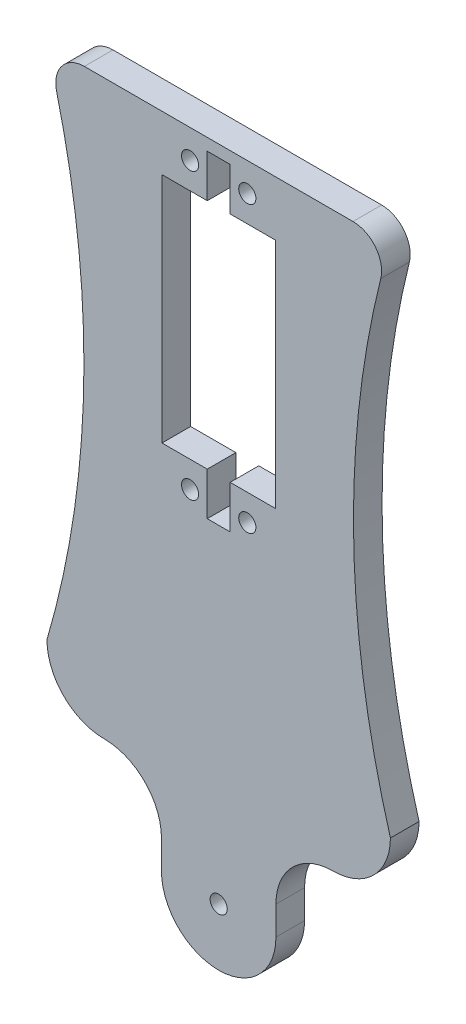
ISO-10303-21;
HEADER;
FILE_DESCRIPTION(('STEP AP214'),'2;1');
FILE_NAME('part.step','',(''),(''),'','','');
FILE_SCHEMA(('AUTOMOTIVE_DESIGN { 1 0 10303 214 1 1 1 1 }'));
ENDSEC;
DATA;
#1=APPLICATION_CONTEXT('core data for automotive mechanical design processes');
#2=APPLICATION_PROTOCOL_DEFINITION('international standard','automotive_design',2000,#1);
#3=PRODUCT_CONTEXT('',#1,'mechanical');
#4=PRODUCT('Part','Part','',(#3));
#5=PRODUCT_RELATED_PRODUCT_CATEGORY('part','',(#4));
#6=PRODUCT_DEFINITION_FORMATION('','',#4);
#7=PRODUCT_DEFINITION_CONTEXT('part definition',#1,'design');
#8=PRODUCT_DEFINITION('design','',#6,#7);
#9=PRODUCT_DEFINITION_SHAPE('','',#8);
#10=(LENGTH_UNIT() NAMED_UNIT(*) SI_UNIT(.MILLI.,.METRE.));
#11=(NAMED_UNIT(*) PLANE_ANGLE_UNIT() SI_UNIT($,.RADIAN.));
#12=(NAMED_UNIT(*) SI_UNIT($,.STERADIAN.) SOLID_ANGLE_UNIT());
#13=UNCERTAINTY_MEASURE_WITH_UNIT(LENGTH_MEASURE(1.E-05),#10,'distance_accuracy_value','');
#14=(GEOMETRIC_REPRESENTATION_CONTEXT(3) GLOBAL_UNCERTAINTY_ASSIGNED_CONTEXT((#13)) GLOBAL_UNIT_ASSIGNED_CONTEXT((#10,
#11,#12)) REPRESENTATION_CONTEXT('',''));
#15=CARTESIAN_POINT('',(0.,0.,0.));
#16=DIRECTION('',(0.,0.,1.));
#17=DIRECTION('',(1.,0.,0.));
#18=AXIS2_PLACEMENT_3D('',#15,#16,#17);
#19=CARTESIAN_POINT('',(-4.08966397750088,13.1353936637728,5.));
#20=DIRECTION('',(0.,0.,1.));
#21=DIRECTION('',(1.,0.,0.));
#22=AXIS2_PLACEMENT_3D('',#19,#20,#21);
#23=PLANE('',#22);
#24=DIRECTION('',(0.,-1.,0.));
#25=VECTOR('',#24,1.);
#26=CARTESIAN_POINT('',(-13.9896639775009,118.545393663773,5.));
#27=LINE('',#26,#25);
#28=CARTESIAN_POINT('',(-13.9896639775009,118.545393663773,5.));
#29=VERTEX_POINT('',#28);
#30=CARTESIAN_POINT('',(-13.9896639775009,77.9453936637728,5.));
#31=VERTEX_POINT('',#30);
#32=EDGE_CURVE('E49',#29,#31,#27,.T.);
#33=ORIENTED_EDGE('',*,*,#32,.F.);
#34=DIRECTION('',(-1.,0.,0.));
#35=VECTOR('',#34,1.);
#36=CARTESIAN_POINT('',(-13.9896639775009,118.545393663773,5.));
#37=LINE('',#36,#35);
#38=CARTESIAN_POINT('',(-6.08966397750087,118.545393663773,5.));
#39=VERTEX_POINT('',#38);
#40=EDGE_CURVE('E214',#39,#29,#37,.T.);
#41=ORIENTED_EDGE('',*,*,#40,.F.);
#42=DIRECTION('',(0.,-1.,0.));
#43=VECTOR('',#42,1.);
#44=CARTESIAN_POINT('',(-6.08966397750087,118.545393663773,5.));
#45=LINE('',#44,#43);
#46=CARTESIAN_POINT('',(-6.08966397750087,126.045393663773,5.));
#47=VERTEX_POINT('',#46);
#48=EDGE_CURVE('E217',#47,#39,#45,.T.);
#49=ORIENTED_EDGE('',*,*,#48,.F.);
#50=DIRECTION('',(-1.,0.,0.));
#51=VECTOR('',#50,1.);
#52=CARTESIAN_POINT('',(-2.08966397750087,126.045393663773,5.));
#53=LINE('',#52,#51);
#54=CARTESIAN_POINT('',(-2.08966397750087,126.045393663773,5.));
#55=VERTEX_POINT('',#54);
#56=EDGE_CURVE('E269',#55,#47,#53,.T.);
#57=ORIENTED_EDGE('',*,*,#56,.F.);
#58=DIRECTION('',(0.,1.,0.));
#59=VECTOR('',#58,1.);
#60=CARTESIAN_POINT('',(-2.08966397750087,118.545393663773,5.));
#61=LINE('',#60,#59);
#62=CARTESIAN_POINT('',(-2.08966397750087,118.545393663773,5.));
#63=VERTEX_POINT('',#62);
#64=EDGE_CURVE('E266',#63,#55,#61,.T.);
#65=ORIENTED_EDGE('',*,*,#64,.F.);
#66=DIRECTION('',(-1.,0.,0.));
#67=VECTOR('',#66,1.);
#68=CARTESIAN_POINT('',(-2.08966397750087,118.545393663773,5.));
#69=LINE('',#68,#67);
#70=CARTESIAN_POINT('',(5.81033602249911,118.545393663773,5.));
#71=VERTEX_POINT('',#70);
#72=EDGE_CURVE('E263',#71,#63,#69,.T.);
#73=ORIENTED_EDGE('',*,*,#72,.F.);
#74=DIRECTION('',(0.,1.,0.));
#75=VECTOR('',#74,1.);
#76=CARTESIAN_POINT('',(5.81033602249911,118.545393663773,5.));
#77=LINE('',#76,#75);
#78=CARTESIAN_POINT('',(5.81033602249911,77.9453936637728,5.));
#79=VERTEX_POINT('',#78);
#80=EDGE_CURVE('E260',#79,#71,#77,.T.);
#81=ORIENTED_EDGE('',*,*,#80,.F.);
#82=DIRECTION('',(1.,0.,0.));
#83=VECTOR('',#82,1.);
#84=CARTESIAN_POINT('',(-2.08966397750088,77.9453936637728,5.));
#85=LINE('',#84,#83);
#86=CARTESIAN_POINT('',(-2.08966397750088,77.9453936637728,5.));
#87=VERTEX_POINT('',#86);
#88=EDGE_CURVE('E257',#87,#79,#85,.T.);
#89=ORIENTED_EDGE('',*,*,#88,.F.);
#90=DIRECTION('',(0.,1.,0.));
#91=VECTOR('',#90,1.);
#92=CARTESIAN_POINT('',(-2.08966397750088,77.9453936637728,5.));
#93=LINE('',#92,#91);
#94=CARTESIAN_POINT('',(-2.08966397750087,70.4453936637728,5.));
#95=VERTEX_POINT('',#94);
#96=EDGE_CURVE('E254',#95,#87,#93,.T.);
#97=ORIENTED_EDGE('',*,*,#96,.F.);
#98=DIRECTION('',(1.,0.,0.));
#99=VECTOR('',#98,1.);
#100=CARTESIAN_POINT('',(-6.08966397750089,70.4453936637728,5.));
#101=LINE('',#100,#99);
#102=CARTESIAN_POINT('',(-6.08966397750089,70.4453936637728,5.));
#103=VERTEX_POINT('',#102);
#104=EDGE_CURVE('E251',#103,#95,#101,.T.);
#105=ORIENTED_EDGE('',*,*,#104,.F.);
#106=DIRECTION('',(0.,-1.,0.));
#107=VECTOR('',#106,1.);
#108=CARTESIAN_POINT('',(-6.08966397750089,77.9453936637728,5.));
#109=LINE('',#108,#107);
#110=CARTESIAN_POINT('',(-6.08966397750089,77.9453936637728,5.));
#111=VERTEX_POINT('',#110);
#112=EDGE_CURVE('E248',#111,#103,#109,.T.);
#113=ORIENTED_EDGE('',*,*,#112,.F.);
#114=DIRECTION('',(1.,0.,0.));
#115=VECTOR('',#114,1.);
#116=CARTESIAN_POINT('',(-13.9896639775009,77.9453936637728,5.));
#117=LINE('',#116,#115);
#118=EDGE_CURVE('E246',#31,#111,#117,.T.);
#119=ORIENTED_EDGE('',*,*,#118,.F.);
#120=EDGE_LOOP('',(#33,#41,#49,#57,#65,#73,#81,#89,#97,#105,#113,#119));
#121=FACE_BOUND('',#120,.T.);
#122=CARTESIAN_POINT('',(0.910336022499125,123.135393663773,5.));
#123=DIRECTION('',(0.,0.,1.));
#124=DIRECTION('',(1.,0.,0.));
#125=AXIS2_PLACEMENT_3D('',#122,#123,#124);
#126=CIRCLE('',#125,1.5);
#127=CARTESIAN_POINT('',(2.41033602249913,123.135393663773,5.));
#128=VERTEX_POINT('',#127);
#129=EDGE_CURVE('E300',#128,#128,#126,.T.);
#130=ORIENTED_EDGE('',*,*,#129,.F.);
#131=EDGE_LOOP('',(#130));
#132=FACE_BOUND('',#131,.T.);
#133=CARTESIAN_POINT('',(-9.08966397750089,73.3553936637728,5.));
#134=DIRECTION('',(0.,0.,1.));
#135=DIRECTION('',(1.,0.,0.));
#136=AXIS2_PLACEMENT_3D('',#133,#134,#135);
#137=CIRCLE('',#136,1.5);
#138=CARTESIAN_POINT('',(-7.58966397750089,73.3553936637728,5.));
#139=VERTEX_POINT('',#138);
#140=EDGE_CURVE('E306',#139,#139,#137,.T.);
#141=ORIENTED_EDGE('',*,*,#140,.F.);
#142=EDGE_LOOP('',(#141));
#143=FACE_BOUND('',#142,.T.);
#144=CARTESIAN_POINT('',(0.910336022499125,73.3553936637728,5.));
#145=DIRECTION('',(0.,0.,1.));
#146=DIRECTION('',(1.,0.,0.));
#147=AXIS2_PLACEMENT_3D('',#144,#145,#146);
#148=CIRCLE('',#147,1.5);
#149=CARTESIAN_POINT('',(2.41033602249913,73.3553936637728,5.));
#150=VERTEX_POINT('',#149);
#151=EDGE_CURVE('E276',#150,#150,#148,.T.);
#152=ORIENTED_EDGE('',*,*,#151,.F.);
#153=EDGE_LOOP('',(#152));
#154=FACE_BOUND('',#153,.T.);
#155=CARTESIAN_POINT('',(-9.08966397750087,123.135393663773,5.));
#156=DIRECTION('',(0.,0.,1.));
#157=DIRECTION('',(1.,0.,0.));
#158=AXIS2_PLACEMENT_3D('',#155,#156,#157);
#159=CIRCLE('',#158,1.5);
#160=CARTESIAN_POINT('',(-7.58966397750087,123.135393663773,5.));
#161=VERTEX_POINT('',#160);
#162=EDGE_CURVE('E299',#161,#161,#159,.T.);
#163=ORIENTED_EDGE('',*,*,#162,.F.);
#164=EDGE_LOOP('',(#163));
#165=FACE_BOUND('',#164,.T.);
#166=CARTESIAN_POINT('',(-4.08966397750088,13.1353936637728,5.));
#167=DIRECTION('',(0.,0.,1.));
#168=DIRECTION('',(1.,0.,0.));
#169=AXIS2_PLACEMENT_3D('',#166,#167,#168);
#170=CIRCLE('',#169,1.5);
#171=CARTESIAN_POINT('',(-2.58966397750088,13.1353936637728,5.));
#172=VERTEX_POINT('',#171);
#173=EDGE_CURVE('E336',#172,#172,#170,.T.);
#174=ORIENTED_EDGE('',*,*,#173,.F.);
#175=EDGE_LOOP('',(#174));
#176=FACE_BOUND('',#175,.T.);
#177=CARTESIAN_POINT('',(179.45186135034,83.1353936637728,5.));
#178=DIRECTION('',(0.,0.,1.));
#179=DIRECTION('',(1.,0.,0.));
#180=AXIS2_PLACEMENT_3D('',#177,#178,#179);
#181=CIRCLE('',#180,160.);
#182=CARTESIAN_POINT('',(25.9103360224991,38.1353936637728,5.));
#183=VERTEX_POINT('',#182);
#184=CARTESIAN_POINT('',(24.2246071095436,121.923272451652,5.));
#185=VERTEX_POINT('',#184);
#186=EDGE_CURVE('E317',#183,#185,#181,.F.);
#187=ORIENTED_EDGE('',*,*,#186,.T.);
#188=CARTESIAN_POINT('',(19.3737554145187,123.135393663773,5.));
#189=DIRECTION('',(0.,0.,1.));
#190=DIRECTION('',(1.,0.,0.));
#191=AXIS2_PLACEMENT_3D('',#188,#189,#190);
#192=CIRCLE('',#191,5.);
#193=CARTESIAN_POINT('',(19.3737554145187,128.135393663773,5.));
#194=VERTEX_POINT('',#193);
#195=EDGE_CURVE('E42',#185,#194,#192,.T.);
#196=ORIENTED_EDGE('',*,*,#195,.T.);
#197=DIRECTION('',(-1.,0.,0.));
#198=VECTOR('',#197,1.);
#199=CARTESIAN_POINT('',(-34.0896639775009,128.135393663773,5.));
#200=LINE('',#199,#198);
#201=CARTESIAN_POINT('',(-27.5530833695205,128.135393663773,5.));
#202=VERTEX_POINT('',#201);
#203=EDGE_CURVE('E347',#194,#202,#200,.T.);
#204=ORIENTED_EDGE('',*,*,#203,.T.);
#205=CARTESIAN_POINT('',(-27.5530833695205,123.135393663773,5.));
#206=DIRECTION('',(0.,0.,1.));
#207=DIRECTION('',(1.,0.,0.));
#208=AXIS2_PLACEMENT_3D('',#205,#206,#207);
#209=CIRCLE('',#208,5.);
#210=CARTESIAN_POINT('',(-32.4039350645454,121.923272451652,5.));
#211=VERTEX_POINT('',#210);
#212=EDGE_CURVE('E409',#202,#211,#209,.T.);
#213=ORIENTED_EDGE('',*,*,#212,.T.);
#214=CARTESIAN_POINT('',(-187.631189305342,83.1353936637728,5.));
#215=DIRECTION('',(0.,0.,1.));
#216=DIRECTION('',(1.,0.,0.));
#217=AXIS2_PLACEMENT_3D('',#214,#215,#216);
#218=CIRCLE('',#217,160.);
#219=CARTESIAN_POINT('',(-34.0896639775009,38.1353936637728,5.));
#220=VERTEX_POINT('',#219);
#221=EDGE_CURVE('E323',#220,#211,#218,.T.);
#222=ORIENTED_EDGE('',*,*,#221,.F.);
#223=CARTESIAN_POINT('',(-24.0896639775009,38.1353936637728,5.));
#224=DIRECTION('',(0.,0.,1.));
#225=DIRECTION('',(1.,0.,0.));
#226=AXIS2_PLACEMENT_3D('',#223,#224,#225);
#227=CIRCLE('',#226,10.);
#228=CARTESIAN_POINT('',(-24.0896639775009,28.1353936637728,5.));
#229=VERTEX_POINT('',#228);
#230=EDGE_CURVE('E377',#220,#229,#227,.T.);
#231=ORIENTED_EDGE('',*,*,#230,.T.);
#232=CARTESIAN_POINT('',(-24.0896639775009,18.1353936637728,5.));
#233=DIRECTION('',(0.,0.,1.));
#234=DIRECTION('',(1.,0.,0.));
#235=AXIS2_PLACEMENT_3D('',#232,#233,#234);
#236=CIRCLE('',#235,10.);
#237=CARTESIAN_POINT('',(-14.0896639775009,18.1353936637728,5.));
#238=VERTEX_POINT('',#237);
#239=EDGE_CURVE('E392',#229,#238,#236,.F.);
#240=ORIENTED_EDGE('',*,*,#239,.T.);
#241=DIRECTION('',(0.,-1.,0.));
#242=VECTOR('',#241,1.);
#243=CARTESIAN_POINT('',(-14.0896639775009,13.1353936637728,5.));
#244=LINE('',#243,#242);
#245=CARTESIAN_POINT('',(-14.0896639775009,13.1353936637728,5.));
#246=VERTEX_POINT('',#245);
#247=EDGE_CURVE('E350',#238,#246,#244,.T.);
#248=ORIENTED_EDGE('',*,*,#247,.T.);
#249=CARTESIAN_POINT('',(-4.08966397750088,13.1353936637728,5.));
#250=DIRECTION('',(0.,0.,1.));
#251=DIRECTION('',(1.,0.,0.));
#252=AXIS2_PLACEMENT_3D('',#249,#250,#251);
#253=CIRCLE('',#252,10.);
#254=CARTESIAN_POINT('',(5.91033602249912,13.1353936637728,5.));
#255=VERTEX_POINT('',#254);
#256=EDGE_CURVE('E340',#246,#255,#253,.T.);
#257=ORIENTED_EDGE('',*,*,#256,.T.);
#258=DIRECTION('',(0.,1.,0.));
#259=VECTOR('',#258,1.);
#260=CARTESIAN_POINT('',(5.91033602249912,13.1353936637728,5.));
#261=LINE('',#260,#259);
#262=CARTESIAN_POINT('',(5.91033602249912,18.1353936637728,5.));
#263=VERTEX_POINT('',#262);
#264=EDGE_CURVE('E343',#255,#263,#261,.T.);
#265=ORIENTED_EDGE('',*,*,#264,.T.);
#266=CARTESIAN_POINT('',(15.9103360224991,18.1353936637728,5.));
#267=DIRECTION('',(0.,0.,1.));
#268=DIRECTION('',(1.,0.,0.));
#269=AXIS2_PLACEMENT_3D('',#266,#267,#268);
#270=CIRCLE('',#269,10.);
#271=CARTESIAN_POINT('',(15.9103360224991,28.1353936637728,5.));
#272=VERTEX_POINT('',#271);
#273=EDGE_CURVE('E388',#263,#272,#270,.F.);
#274=ORIENTED_EDGE('',*,*,#273,.T.);
#275=CARTESIAN_POINT('',(15.9103360224991,38.1353936637728,5.));
#276=DIRECTION('',(0.,0.,1.));
#277=DIRECTION('',(1.,0.,0.));
#278=AXIS2_PLACEMENT_3D('',#275,#276,#277);
#279=CIRCLE('',#278,10.);
#280=EDGE_CURVE('E379',#272,#183,#279,.T.);
#281=ORIENTED_EDGE('',*,*,#280,.T.);
#282=EDGE_LOOP('',(#187,#196,#204,#213,#222,#231,#240,#248,#257,#265,#274,#281));
#283=FACE_BOUND('',#282,.T.);
#284=ADVANCED_FACE('F34',(#121,#132,#143,#154,#165,#176,#283),#23,.T.);
#285=CARTESIAN_POINT('',(-4.08966397750088,13.1353936637728,0.));
#286=DIRECTION('',(0.,0.,1.));
#287=DIRECTION('',(1.,0.,0.));
#288=AXIS2_PLACEMENT_3D('',#285,#286,#287);
#289=PLANE('',#288);
#290=DIRECTION('',(-1.,0.,0.));
#291=VECTOR('',#290,1.);
#292=CARTESIAN_POINT('',(-13.9896639775009,118.545393663773,0.));
#293=LINE('',#292,#291);
#294=CARTESIAN_POINT('',(-6.08966397750087,118.545393663773,0.));
#295=VERTEX_POINT('',#294);
#296=CARTESIAN_POINT('',(-13.9896639775009,118.545393663773,0.));
#297=VERTEX_POINT('',#296);
#298=EDGE_CURVE('E203',#295,#297,#293,.T.);
#299=ORIENTED_EDGE('',*,*,#298,.T.);
#300=DIRECTION('',(0.,-1.,0.));
#301=VECTOR('',#300,1.);
#302=CARTESIAN_POINT('',(-13.9896639775009,118.545393663773,0.));
#303=LINE('',#302,#301);
#304=CARTESIAN_POINT('',(-13.9896639775009,77.9453936637728,0.));
#305=VERTEX_POINT('',#304);
#306=EDGE_CURVE('E197',#297,#305,#303,.T.);
#307=ORIENTED_EDGE('',*,*,#306,.T.);
#308=DIRECTION('',(1.,0.,0.));
#309=VECTOR('',#308,1.);
#310=CARTESIAN_POINT('',(-13.9896639775009,77.9453936637728,0.));
#311=LINE('',#310,#309);
#312=CARTESIAN_POINT('',(-6.08966397750089,77.9453936637728,0.));
#313=VERTEX_POINT('',#312);
#314=EDGE_CURVE('E206',#305,#313,#311,.T.);
#315=ORIENTED_EDGE('',*,*,#314,.T.);
#316=DIRECTION('',(0.,-1.,0.));
#317=VECTOR('',#316,1.);
#318=CARTESIAN_POINT('',(-6.08966397750089,77.9453936637728,0.));
#319=LINE('',#318,#317);
#320=CARTESIAN_POINT('',(-6.08966397750089,70.4453936637728,0.));
#321=VERTEX_POINT('',#320);
#322=EDGE_CURVE('E57',#313,#321,#319,.T.);
#323=ORIENTED_EDGE('',*,*,#322,.T.);
#324=DIRECTION('',(1.,0.,0.));
#325=VECTOR('',#324,1.);
#326=CARTESIAN_POINT('',(-6.08966397750089,70.4453936637728,0.));
#327=LINE('',#326,#325);
#328=CARTESIAN_POINT('',(-2.08966397750087,70.4453936637728,0.));
#329=VERTEX_POINT('',#328);
#330=EDGE_CURVE('E221',#321,#329,#327,.T.);
#331=ORIENTED_EDGE('',*,*,#330,.T.);
#332=DIRECTION('',(0.,1.,0.));
#333=VECTOR('',#332,1.);
#334=CARTESIAN_POINT('',(-2.08966397750088,77.9453936637728,0.));
#335=LINE('',#334,#333);
#336=CARTESIAN_POINT('',(-2.08966397750088,77.9453936637728,0.));
#337=VERTEX_POINT('',#336);
#338=EDGE_CURVE('E224',#329,#337,#335,.T.);
#339=ORIENTED_EDGE('',*,*,#338,.T.);
#340=DIRECTION('',(1.,0.,0.));
#341=VECTOR('',#340,1.);
#342=CARTESIAN_POINT('',(-2.08966397750088,77.9453936637728,0.));
#343=LINE('',#342,#341);
#344=CARTESIAN_POINT('',(5.81033602249911,77.9453936637728,0.));
#345=VERTEX_POINT('',#344);
#346=EDGE_CURVE('E227',#337,#345,#343,.T.);
#347=ORIENTED_EDGE('',*,*,#346,.T.);
#348=DIRECTION('',(0.,1.,0.));
#349=VECTOR('',#348,1.);
#350=CARTESIAN_POINT('',(5.81033602249911,118.545393663773,0.));
#351=LINE('',#350,#349);
#352=CARTESIAN_POINT('',(5.81033602249911,118.545393663773,0.));
#353=VERTEX_POINT('',#352);
#354=EDGE_CURVE('E230',#345,#353,#351,.T.);
#355=ORIENTED_EDGE('',*,*,#354,.T.);
#356=DIRECTION('',(-1.,0.,0.));
#357=VECTOR('',#356,1.);
#358=CARTESIAN_POINT('',(-2.08966397750087,118.545393663773,0.));
#359=LINE('',#358,#357);
#360=CARTESIAN_POINT('',(-2.08966397750087,118.545393663773,0.));
#361=VERTEX_POINT('',#360);
#362=EDGE_CURVE('E233',#353,#361,#359,.T.);
#363=ORIENTED_EDGE('',*,*,#362,.T.);
#364=DIRECTION('',(0.,1.,0.));
#365=VECTOR('',#364,1.);
#366=CARTESIAN_POINT('',(-2.08966397750087,118.545393663773,0.));
#367=LINE('',#366,#365);
#368=CARTESIAN_POINT('',(-2.08966397750087,126.045393663773,0.));
#369=VERTEX_POINT('',#368);
#370=EDGE_CURVE('E236',#361,#369,#367,.T.);
#371=ORIENTED_EDGE('',*,*,#370,.T.);
#372=DIRECTION('',(-1.,0.,0.));
#373=VECTOR('',#372,1.);
#374=CARTESIAN_POINT('',(-2.08966397750087,126.045393663773,0.));
#375=LINE('',#374,#373);
#376=CARTESIAN_POINT('',(-6.08966397750087,126.045393663773,0.));
#377=VERTEX_POINT('',#376);
#378=EDGE_CURVE('E239',#369,#377,#375,.T.);
#379=ORIENTED_EDGE('',*,*,#378,.T.);
#380=DIRECTION('',(0.,-1.,0.));
#381=VECTOR('',#380,1.);
#382=CARTESIAN_POINT('',(-6.08966397750087,118.545393663773,0.));
#383=LINE('',#382,#381);
#384=EDGE_CURVE('E242',#377,#295,#383,.T.);
#385=ORIENTED_EDGE('',*,*,#384,.T.);
#386=EDGE_LOOP('',(#299,#307,#315,#323,#331,#339,#347,#355,#363,#371,#379,#385));
#387=FACE_BOUND('',#386,.T.);
#388=CARTESIAN_POINT('',(0.910336022499125,123.135393663773,0.));
#389=DIRECTION('',(0.,0.,1.));
#390=DIRECTION('',(1.,0.,0.));
#391=AXIS2_PLACEMENT_3D('',#388,#389,#390);
#392=CIRCLE('',#391,1.5);
#393=CARTESIAN_POINT('',(2.41033602249913,123.135393663773,0.));
#394=VERTEX_POINT('',#393);
#395=EDGE_CURVE('E296',#394,#394,#392,.T.);
#396=ORIENTED_EDGE('',*,*,#395,.T.);
#397=EDGE_LOOP('',(#396));
#398=FACE_BOUND('',#397,.T.);
#399=CARTESIAN_POINT('',(-9.08966397750089,73.3553936637728,0.));
#400=DIRECTION('',(0.,0.,1.));
#401=DIRECTION('',(1.,0.,0.));
#402=AXIS2_PLACEMENT_3D('',#399,#400,#401);
#403=CIRCLE('',#402,1.5);
#404=CARTESIAN_POINT('',(-7.58966397750089,73.3553936637728,0.));
#405=VERTEX_POINT('',#404);
#406=EDGE_CURVE('E303',#405,#405,#403,.T.);
#407=ORIENTED_EDGE('',*,*,#406,.T.);
#408=EDGE_LOOP('',(#407));
#409=FACE_BOUND('',#408,.T.);
#410=CARTESIAN_POINT('',(0.910336022499125,73.3553936637728,0.));
#411=DIRECTION('',(0.,0.,1.));
#412=DIRECTION('',(1.,0.,0.));
#413=AXIS2_PLACEMENT_3D('',#410,#411,#412);
#414=CIRCLE('',#413,1.5);
#415=CARTESIAN_POINT('',(2.41033602249913,73.3553936637728,0.));
#416=VERTEX_POINT('',#415);
#417=EDGE_CURVE('E309',#416,#416,#414,.T.);
#418=ORIENTED_EDGE('',*,*,#417,.T.);
#419=EDGE_LOOP('',(#418));
#420=FACE_BOUND('',#419,.T.);
#421=CARTESIAN_POINT('',(-9.08966397750087,123.135393663773,0.));
#422=DIRECTION('',(0.,0.,1.));
#423=DIRECTION('',(1.,0.,0.));
#424=AXIS2_PLACEMENT_3D('',#421,#422,#423);
#425=CIRCLE('',#424,1.5);
#426=CARTESIAN_POINT('',(-7.58966397750087,123.135393663773,0.));
#427=VERTEX_POINT('',#426);
#428=EDGE_CURVE('E314',#427,#427,#425,.T.);
#429=ORIENTED_EDGE('',*,*,#428,.T.);
#430=EDGE_LOOP('',(#429));
#431=FACE_BOUND('',#430,.T.);
#432=CARTESIAN_POINT('',(-4.08966397750088,13.1353936637728,0.));
#433=DIRECTION('',(0.,0.,1.));
#434=DIRECTION('',(1.,0.,0.));
#435=AXIS2_PLACEMENT_3D('',#432,#433,#434);
#436=CIRCLE('',#435,1.5);
#437=CARTESIAN_POINT('',(-2.58966397750088,13.1353936637728,0.));
#438=VERTEX_POINT('',#437);
#439=EDGE_CURVE('E332',#438,#438,#436,.T.);
#440=ORIENTED_EDGE('',*,*,#439,.T.);
#441=EDGE_LOOP('',(#440));
#442=FACE_BOUND('',#441,.T.);
#443=DIRECTION('',(-1.,0.,0.));
#444=VECTOR('',#443,1.);
#445=CARTESIAN_POINT('',(-34.0896639775009,128.135393663773,0.));
#446=LINE('',#445,#444);
#447=CARTESIAN_POINT('',(19.3737554145187,128.135393663773,0.));
#448=VERTEX_POINT('',#447);
#449=CARTESIAN_POINT('',(-27.5530833695205,128.135393663773,0.));
#450=VERTEX_POINT('',#449);
#451=EDGE_CURVE('E358',#448,#450,#446,.T.);
#452=ORIENTED_EDGE('',*,*,#451,.F.);
#453=CARTESIAN_POINT('',(19.3737554145187,123.135393663773,0.));
#454=DIRECTION('',(0.,0.,1.));
#455=DIRECTION('',(1.,0.,0.));
#456=AXIS2_PLACEMENT_3D('',#453,#454,#455);
#457=CIRCLE('',#456,5.);
#458=CARTESIAN_POINT('',(24.2246071095436,121.923272451652,0.));
#459=VERTEX_POINT('',#458);
#460=EDGE_CURVE('E405',#448,#459,#457,.F.);
#461=ORIENTED_EDGE('',*,*,#460,.T.);
#462=CARTESIAN_POINT('',(179.45186135034,83.1353936637728,0.));
#463=DIRECTION('',(0.,0.,1.));
#464=DIRECTION('',(1.,0.,0.));
#465=AXIS2_PLACEMENT_3D('',#462,#463,#464);
#466=CIRCLE('',#465,160.);
#467=CARTESIAN_POINT('',(25.9103360224991,38.1353936637728,0.));
#468=VERTEX_POINT('',#467);
#469=EDGE_CURVE('E320',#468,#459,#466,.F.);
#470=ORIENTED_EDGE('',*,*,#469,.F.);
#471=CARTESIAN_POINT('',(15.9103360224991,38.1353936637728,0.));
#472=DIRECTION('',(0.,0.,1.));
#473=DIRECTION('',(1.,0.,0.));
#474=AXIS2_PLACEMENT_3D('',#471,#472,#473);
#475=CIRCLE('',#474,10.);
#476=CARTESIAN_POINT('',(15.9103360224991,28.1353936637728,0.));
#477=VERTEX_POINT('',#476);
#478=EDGE_CURVE('E375',#468,#477,#475,.F.);
#479=ORIENTED_EDGE('',*,*,#478,.T.);
#480=CARTESIAN_POINT('',(15.9103360224991,18.1353936637728,0.));
#481=DIRECTION('',(0.,0.,1.));
#482=DIRECTION('',(1.,0.,0.));
#483=AXIS2_PLACEMENT_3D('',#480,#481,#482);
#484=CIRCLE('',#483,10.);
#485=CARTESIAN_POINT('',(5.91033602249912,18.1353936637728,0.));
#486=VERTEX_POINT('',#485);
#487=EDGE_CURVE('E386',#477,#486,#484,.T.);
#488=ORIENTED_EDGE('',*,*,#487,.T.);
#489=DIRECTION('',(0.,1.,0.));
#490=VECTOR('',#489,1.);
#491=CARTESIAN_POINT('',(5.91033602249912,13.1353936637728,0.));
#492=LINE('',#491,#490);
#493=CARTESIAN_POINT('',(5.91033602249912,13.1353936637728,0.));
#494=VERTEX_POINT('',#493);
#495=EDGE_CURVE('E355',#494,#486,#492,.T.);
#496=ORIENTED_EDGE('',*,*,#495,.F.);
#497=CARTESIAN_POINT('',(-4.08966397750088,13.1353936637728,0.));
#498=DIRECTION('',(0.,0.,1.));
#499=DIRECTION('',(1.,0.,0.));
#500=AXIS2_PLACEMENT_3D('',#497,#498,#499);
#501=CIRCLE('',#500,10.);
#502=CARTESIAN_POINT('',(-14.0896639775009,13.1353936637728,0.));
#503=VERTEX_POINT('',#502);
#504=EDGE_CURVE('E335',#503,#494,#501,.T.);
#505=ORIENTED_EDGE('',*,*,#504,.F.);
#506=DIRECTION('',(0.,-1.,0.));
#507=VECTOR('',#506,1.);
#508=CARTESIAN_POINT('',(-14.0896639775009,13.1353936637728,0.));
#509=LINE('',#508,#507);
#510=CARTESIAN_POINT('',(-14.0896639775009,18.1353936637728,0.));
#511=VERTEX_POINT('',#510);
#512=EDGE_CURVE('E344',#511,#503,#509,.T.);
#513=ORIENTED_EDGE('',*,*,#512,.F.);
#514=CARTESIAN_POINT('',(-24.0896639775009,18.1353936637728,0.));
#515=DIRECTION('',(0.,0.,1.));
#516=DIRECTION('',(1.,0.,0.));
#517=AXIS2_PLACEMENT_3D('',#514,#515,#516);
#518=CIRCLE('',#517,10.);
#519=CARTESIAN_POINT('',(-24.0896639775009,28.1353936637728,0.));
#520=VERTEX_POINT('',#519);
#521=EDGE_CURVE('E390',#511,#520,#518,.T.);
#522=ORIENTED_EDGE('',*,*,#521,.T.);
#523=CARTESIAN_POINT('',(-24.0896639775009,38.1353936637728,0.));
#524=DIRECTION('',(0.,0.,1.));
#525=DIRECTION('',(1.,0.,0.));
#526=AXIS2_PLACEMENT_3D('',#523,#524,#525);
#527=CIRCLE('',#526,10.);
#528=CARTESIAN_POINT('',(-34.0896639775009,38.1353936637728,0.));
#529=VERTEX_POINT('',#528);
#530=EDGE_CURVE('E372',#520,#529,#527,.F.);
#531=ORIENTED_EDGE('',*,*,#530,.T.);
#532=CARTESIAN_POINT('',(-187.631189305342,83.1353936637728,0.));
#533=DIRECTION('',(0.,0.,1.));
#534=DIRECTION('',(1.,0.,0.));
#535=AXIS2_PLACEMENT_3D('',#532,#533,#534);
#536=CIRCLE('',#535,160.);
#537=CARTESIAN_POINT('',(-32.4039350645454,121.923272451652,0.));
#538=VERTEX_POINT('',#537);
#539=EDGE_CURVE('E326',#529,#538,#536,.T.);
#540=ORIENTED_EDGE('',*,*,#539,.T.);
#541=CARTESIAN_POINT('',(-27.5530833695205,123.135393663773,0.));
#542=DIRECTION('',(0.,0.,1.));
#543=DIRECTION('',(1.,0.,0.));
#544=AXIS2_PLACEMENT_3D('',#541,#542,#543);
#545=CIRCLE('',#544,5.);
#546=EDGE_CURVE('E403',#538,#450,#545,.F.);
#547=ORIENTED_EDGE('',*,*,#546,.T.);
#548=EDGE_LOOP('',(#452,#461,#470,#479,#488,#496,#505,#513,#522,#531,#540,#547));
#549=FACE_BOUND('',#548,.T.);
#550=ADVANCED_FACE('F210',(#387,#398,#409,#420,#431,#442,#549),#289,.F.);
#551=CARTESIAN_POINT('',(-4.08966397750088,13.1353936637728,5.));
#552=DIRECTION('',(0.,0.,-1.));
#553=DIRECTION('',(-1.,0.,0.));
#554=AXIS2_PLACEMENT_3D('',#551,#552,#553);
#555=CYLINDRICAL_SURFACE('',#554,10.);
#556=ORIENTED_EDGE('',*,*,#504,.T.);
#557=DIRECTION('',(0.,0.,-1.));
#558=VECTOR('',#557,1.);
#559=CARTESIAN_POINT('',(5.91033602249912,13.1353936637728,5.));
#560=LINE('',#559,#558);
#561=EDGE_CURVE('E364',#255,#494,#560,.T.);
#562=ORIENTED_EDGE('',*,*,#561,.F.);
#563=ORIENTED_EDGE('',*,*,#256,.F.);
#564=DIRECTION('',(0.,0.,-1.));
#565=VECTOR('',#564,1.);
#566=CARTESIAN_POINT('',(-14.0896639775009,13.1353936637728,5.));
#567=LINE('',#566,#565);
#568=EDGE_CURVE('E352',#246,#503,#567,.T.);
#569=ORIENTED_EDGE('',*,*,#568,.T.);
#570=EDGE_LOOP('',(#556,#562,#563,#569));
#571=FACE_BOUND('',#570,.T.);
#572=ADVANCED_FACE('F444',(#571),#555,.T.);
#573=CARTESIAN_POINT('',(5.91033602249912,13.1353936637728,5.));
#574=DIRECTION('',(-1.,0.,0.));
#575=DIRECTION('',(0.,0.,1.));
#576=AXIS2_PLACEMENT_3D('',#573,#574,#575);
#577=PLANE('',#576);
#578=ORIENTED_EDGE('',*,*,#495,.T.);
#579=DIRECTION('',(0.,0.,-1.));
#580=VECTOR('',#579,1.);
#581=CARTESIAN_POINT('',(5.91033602249912,18.1353936637728,5.));
#582=LINE('',#581,#580);
#583=EDGE_CURVE('E367',#486,#263,#582,.F.);
#584=ORIENTED_EDGE('',*,*,#583,.T.);
#585=ORIENTED_EDGE('',*,*,#264,.F.);
#586=ORIENTED_EDGE('',*,*,#561,.T.);
#587=EDGE_LOOP('',(#578,#584,#585,#586));
#588=FACE_BOUND('',#587,.T.);
#589=ADVANCED_FACE('F437',(#588),#577,.F.);
#590=CARTESIAN_POINT('',(-34.0896639775009,128.135393663773,5.));
#591=DIRECTION('',(0.,-1.,0.));
#592=DIRECTION('',(0.,0.,-1.));
#593=AXIS2_PLACEMENT_3D('',#590,#591,#592);
#594=PLANE('',#593);
#595=ORIENTED_EDGE('',*,*,#203,.F.);
#596=DIRECTION('',(0.,0.,-1.));
#597=VECTOR('',#596,1.);
#598=CARTESIAN_POINT('',(19.3737554145187,128.135393663773,0.));
#599=LINE('',#598,#597);
#600=EDGE_CURVE('E400',#194,#448,#599,.T.);
#601=ORIENTED_EDGE('',*,*,#600,.T.);
#602=ORIENTED_EDGE('',*,*,#451,.T.);
#603=DIRECTION('',(0.,0.,1.));
#604=VECTOR('',#603,1.);
#605=CARTESIAN_POINT('',(-27.5530833695205,128.135393663773,5.));
#606=LINE('',#605,#604);
#607=EDGE_CURVE('E394',#450,#202,#606,.T.);
#608=ORIENTED_EDGE('',*,*,#607,.T.);
#609=EDGE_LOOP('',(#595,#601,#602,#608));
#610=FACE_BOUND('',#609,.T.);
#611=ADVANCED_FACE('F418',(#610),#594,.F.);
#612=CARTESIAN_POINT('',(-14.0896639775009,13.1353936637728,5.));
#613=DIRECTION('',(1.,0.,0.));
#614=DIRECTION('',(0.,0.,-1.));
#615=AXIS2_PLACEMENT_3D('',#612,#613,#614);
#616=PLANE('',#615);
#617=ORIENTED_EDGE('',*,*,#247,.F.);
#618=DIRECTION('',(0.,0.,-1.));
#619=VECTOR('',#618,1.);
#620=CARTESIAN_POINT('',(-14.0896639775009,18.1353936637728,0.));
#621=LINE('',#620,#619);
#622=EDGE_CURVE('E384',#238,#511,#621,.T.);
#623=ORIENTED_EDGE('',*,*,#622,.T.);
#624=ORIENTED_EDGE('',*,*,#512,.T.);
#625=ORIENTED_EDGE('',*,*,#568,.F.);
#626=EDGE_LOOP('',(#617,#623,#624,#625));
#627=FACE_BOUND('',#626,.T.);
#628=ADVANCED_FACE('F463',(#627),#616,.F.);
#629=CARTESIAN_POINT('',(-4.08966397750088,13.1353936637728,0.));
#630=DIRECTION('',(0.,0.,1.));
#631=DIRECTION('',(1.,0.,0.));
#632=AXIS2_PLACEMENT_3D('',#629,#630,#631);
#633=CYLINDRICAL_SURFACE('',#632,1.5);
#634=ORIENTED_EDGE('',*,*,#439,.F.);
#635=EDGE_LOOP('',(#634));
#636=FACE_BOUND('',#635,.T.);
#637=ORIENTED_EDGE('',*,*,#173,.T.);
#638=EDGE_LOOP('',(#637));
#639=FACE_BOUND('',#638,.T.);
#640=ADVANCED_FACE('F465',(#636,#639),#633,.F.);
#641=CARTESIAN_POINT('',(15.9103360224991,38.1353936637728,5.));
#642=DIRECTION('',(0.,0.,-1.));
#643=DIRECTION('',(-1.,0.,0.));
#644=AXIS2_PLACEMENT_3D('',#641,#642,#643);
#645=CYLINDRICAL_SURFACE('',#644,10.);
#646=DIRECTION('',(0.,0.,-1.));
#647=VECTOR('',#646,1.);
#648=CARTESIAN_POINT('',(25.9103360224991,38.1353936637728,5.));
#649=LINE('',#648,#647);
#650=EDGE_CURVE('E370',#183,#468,#649,.T.);
#651=ORIENTED_EDGE('',*,*,#650,.F.);
#652=ORIENTED_EDGE('',*,*,#280,.F.);
#653=DIRECTION('',(0.,0.,-1.));
#654=VECTOR('',#653,1.);
#655=CARTESIAN_POINT('',(15.9103360224991,28.1353936637728,5.));
#656=LINE('',#655,#654);
#657=EDGE_CURVE('E339',#477,#272,#656,.F.);
#658=ORIENTED_EDGE('',*,*,#657,.F.);
#659=ORIENTED_EDGE('',*,*,#478,.F.);
#660=EDGE_LOOP('',(#651,#652,#658,#659));
#661=FACE_BOUND('',#660,.T.);
#662=ADVANCED_FACE('F430',(#661),#645,.T.);
#663=CARTESIAN_POINT('',(15.9103360224991,18.1353936637728,5.));
#664=DIRECTION('',(0.,0.,1.));
#665=DIRECTION('',(1.,0.,0.));
#666=AXIS2_PLACEMENT_3D('',#663,#664,#665);
#667=CYLINDRICAL_SURFACE('',#666,10.);
#668=ORIENTED_EDGE('',*,*,#273,.F.);
#669=ORIENTED_EDGE('',*,*,#583,.F.);
#670=ORIENTED_EDGE('',*,*,#487,.F.);
#671=ORIENTED_EDGE('',*,*,#657,.T.);
#672=EDGE_LOOP('',(#668,#669,#670,#671));
#673=FACE_BOUND('',#672,.T.);
#674=ADVANCED_FACE('F439',(#673),#667,.F.);
#675=CARTESIAN_POINT('',(-24.0896639775009,18.1353936637728,5.));
#676=DIRECTION('',(0.,0.,1.));
#677=DIRECTION('',(1.,0.,0.));
#678=AXIS2_PLACEMENT_3D('',#675,#676,#677);
#679=CYLINDRICAL_SURFACE('',#678,10.);
#680=ORIENTED_EDGE('',*,*,#622,.F.);
#681=ORIENTED_EDGE('',*,*,#239,.F.);
#682=DIRECTION('',(0.,0.,-1.));
#683=VECTOR('',#682,1.);
#684=CARTESIAN_POINT('',(-24.0896639775009,28.1353936637728,5.));
#685=LINE('',#684,#683);
#686=EDGE_CURVE('E329',#520,#229,#685,.F.);
#687=ORIENTED_EDGE('',*,*,#686,.F.);
#688=ORIENTED_EDGE('',*,*,#521,.F.);
#689=EDGE_LOOP('',(#680,#681,#687,#688));
#690=FACE_BOUND('',#689,.T.);
#691=ADVANCED_FACE('F451',(#690),#679,.F.);
#692=CARTESIAN_POINT('',(-24.0896639775009,38.1353936637728,5.));
#693=DIRECTION('',(0.,0.,-1.));
#694=DIRECTION('',(-1.,0.,0.));
#695=AXIS2_PLACEMENT_3D('',#692,#693,#694);
#696=CYLINDRICAL_SURFACE('',#695,10.);
#697=ORIENTED_EDGE('',*,*,#230,.F.);
#698=DIRECTION('',(0.,0.,-1.));
#699=VECTOR('',#698,1.);
#700=CARTESIAN_POINT('',(-34.0896639775009,38.1353936637728,5.));
#701=LINE('',#700,#699);
#702=EDGE_CURVE('E382',#529,#220,#701,.F.);
#703=ORIENTED_EDGE('',*,*,#702,.F.);
#704=ORIENTED_EDGE('',*,*,#530,.F.);
#705=ORIENTED_EDGE('',*,*,#686,.T.);
#706=EDGE_LOOP('',(#697,#703,#704,#705));
#707=FACE_BOUND('',#706,.T.);
#708=ADVANCED_FACE('F457',(#707),#696,.T.);
#709=CARTESIAN_POINT('',(-187.631189305342,83.1353936637728,0.));
#710=DIRECTION('',(0.,0.,1.));
#711=DIRECTION('',(1.,0.,0.));
#712=AXIS2_PLACEMENT_3D('',#709,#710,#711);
#713=CYLINDRICAL_SURFACE('',#712,160.);
#714=ORIENTED_EDGE('',*,*,#221,.T.);
#715=DIRECTION('',(0.,0.,1.));
#716=VECTOR('',#715,1.);
#717=CARTESIAN_POINT('',(-32.4039350645454,121.923272451652,0.));
#718=LINE('',#717,#716);
#719=EDGE_CURVE('E11',#211,#538,#718,.F.);
#720=ORIENTED_EDGE('',*,*,#719,.T.);
#721=ORIENTED_EDGE('',*,*,#539,.F.);
#722=ORIENTED_EDGE('',*,*,#702,.T.);
#723=EDGE_LOOP('',(#714,#720,#721,#722));
#724=FACE_BOUND('',#723,.T.);
#725=ADVANCED_FACE('F459',(#724),#713,.F.);
#726=CARTESIAN_POINT('',(179.45186135034,83.1353936637728,0.));
#727=DIRECTION('',(0.,0.,1.));
#728=DIRECTION('',(1.,0.,0.));
#729=AXIS2_PLACEMENT_3D('',#726,#727,#728);
#730=CYLINDRICAL_SURFACE('',#729,160.);
#731=ORIENTED_EDGE('',*,*,#469,.T.);
#732=DIRECTION('',(0.,0.,1.));
#733=VECTOR('',#732,1.);
#734=CARTESIAN_POINT('',(24.2246071095436,121.923272451652,0.));
#735=LINE('',#734,#733);
#736=EDGE_CURVE('E407',#459,#185,#735,.T.);
#737=ORIENTED_EDGE('',*,*,#736,.T.);
#738=ORIENTED_EDGE('',*,*,#186,.F.);
#739=ORIENTED_EDGE('',*,*,#650,.T.);
#740=EDGE_LOOP('',(#731,#737,#738,#739));
#741=FACE_BOUND('',#740,.T.);
#742=ADVANCED_FACE('F426',(#741),#730,.F.);
#743=CARTESIAN_POINT('',(-9.08966397750087,123.135393663773,0.));
#744=DIRECTION('',(0.,0.,1.));
#745=DIRECTION('',(1.,0.,0.));
#746=AXIS2_PLACEMENT_3D('',#743,#744,#745);
#747=CYLINDRICAL_SURFACE('',#746,1.5);
#748=ORIENTED_EDGE('',*,*,#428,.F.);
#749=EDGE_LOOP('',(#748));
#750=FACE_BOUND('',#749,.T.);
#751=ORIENTED_EDGE('',*,*,#162,.T.);
#752=EDGE_LOOP('',(#751));
#753=FACE_BOUND('',#752,.T.);
#754=ADVANCED_FACE('F487',(#750,#753),#747,.F.);
#755=CARTESIAN_POINT('',(0.910336022499125,73.3553936637728,0.));
#756=DIRECTION('',(0.,0.,1.));
#757=DIRECTION('',(1.,0.,0.));
#758=AXIS2_PLACEMENT_3D('',#755,#756,#757);
#759=CYLINDRICAL_SURFACE('',#758,1.5);
#760=ORIENTED_EDGE('',*,*,#417,.F.);
#761=EDGE_LOOP('',(#760));
#762=FACE_BOUND('',#761,.T.);
#763=ORIENTED_EDGE('',*,*,#151,.T.);
#764=EDGE_LOOP('',(#763));
#765=FACE_BOUND('',#764,.T.);
#766=ADVANCED_FACE('F490',(#762,#765),#759,.F.);
#767=CARTESIAN_POINT('',(-9.08966397750089,73.3553936637728,0.));
#768=DIRECTION('',(0.,0.,1.));
#769=DIRECTION('',(1.,0.,0.));
#770=AXIS2_PLACEMENT_3D('',#767,#768,#769);
#771=CYLINDRICAL_SURFACE('',#770,1.5);
#772=ORIENTED_EDGE('',*,*,#406,.F.);
#773=EDGE_LOOP('',(#772));
#774=FACE_BOUND('',#773,.T.);
#775=ORIENTED_EDGE('',*,*,#140,.T.);
#776=EDGE_LOOP('',(#775));
#777=FACE_BOUND('',#776,.T.);
#778=ADVANCED_FACE('F494',(#774,#777),#771,.F.);
#779=CARTESIAN_POINT('',(0.910336022499125,123.135393663773,0.));
#780=DIRECTION('',(0.,0.,1.));
#781=DIRECTION('',(1.,0.,0.));
#782=AXIS2_PLACEMENT_3D('',#779,#780,#781);
#783=CYLINDRICAL_SURFACE('',#782,1.5);
#784=ORIENTED_EDGE('',*,*,#395,.F.);
#785=EDGE_LOOP('',(#784));
#786=FACE_BOUND('',#785,.T.);
#787=ORIENTED_EDGE('',*,*,#129,.T.);
#788=EDGE_LOOP('',(#787));
#789=FACE_BOUND('',#788,.T.);
#790=ADVANCED_FACE('F498',(#786,#789),#783,.F.);
#791=CARTESIAN_POINT('',(19.3737554145187,123.135393663773,0.));
#792=DIRECTION('',(0.,0.,1.));
#793=DIRECTION('',(1.,0.,0.));
#794=AXIS2_PLACEMENT_3D('',#791,#792,#793);
#795=CYLINDRICAL_SURFACE('',#794,5.);
#796=ORIENTED_EDGE('',*,*,#195,.F.);
#797=ORIENTED_EDGE('',*,*,#736,.F.);
#798=ORIENTED_EDGE('',*,*,#460,.F.);
#799=ORIENTED_EDGE('',*,*,#600,.F.);
#800=EDGE_LOOP('',(#796,#797,#798,#799));
#801=FACE_BOUND('',#800,.T.);
#802=ADVANCED_FACE('F421',(#801),#795,.T.);
#803=CARTESIAN_POINT('',(-27.5530833695205,123.135393663773,0.));
#804=DIRECTION('',(0.,0.,1.));
#805=DIRECTION('',(1.,0.,0.));
#806=AXIS2_PLACEMENT_3D('',#803,#804,#805);
#807=CYLINDRICAL_SURFACE('',#806,5.);
#808=ORIENTED_EDGE('',*,*,#212,.F.);
#809=ORIENTED_EDGE('',*,*,#607,.F.);
#810=ORIENTED_EDGE('',*,*,#546,.F.);
#811=ORIENTED_EDGE('',*,*,#719,.F.);
#812=EDGE_LOOP('',(#808,#809,#810,#811));
#813=FACE_BOUND('',#812,.T.);
#814=ADVANCED_FACE('F36',(#813),#807,.T.);
#815=CARTESIAN_POINT('',(-13.9896639775009,118.545393663773,0.));
#816=DIRECTION('',(-1.,0.,0.));
#817=DIRECTION('',(0.,-1.,0.));
#818=AXIS2_PLACEMENT_3D('',#815,#816,#817);
#819=PLANE('',#818);
#820=ORIENTED_EDGE('',*,*,#32,.T.);
#821=DIRECTION('',(0.,0.,1.));
#822=VECTOR('',#821,1.);
#823=CARTESIAN_POINT('',(-13.9896639775009,77.9453936637728,0.));
#824=LINE('',#823,#822);
#825=EDGE_CURVE('E193',#305,#31,#824,.T.);
#826=ORIENTED_EDGE('',*,*,#825,.F.);
#827=ORIENTED_EDGE('',*,*,#306,.F.);
#828=DIRECTION('',(0.,0.,1.));
#829=VECTOR('',#828,1.);
#830=CARTESIAN_POINT('',(-13.9896639775009,118.545393663773,0.));
#831=LINE('',#830,#829);
#832=EDGE_CURVE('E274',#297,#29,#831,.T.);
#833=ORIENTED_EDGE('',*,*,#832,.T.);
#834=EDGE_LOOP('',(#820,#826,#827,#833));
#835=FACE_BOUND('',#834,.T.);
#836=ADVANCED_FACE('F195',(#835),#819,.F.);
#837=CARTESIAN_POINT('',(-13.9896639775009,118.545393663773,0.));
#838=DIRECTION('',(0.,1.,0.));
#839=DIRECTION('',(0.,0.,1.));
#840=AXIS2_PLACEMENT_3D('',#837,#838,#839);
#841=PLANE('',#840);
#842=ORIENTED_EDGE('',*,*,#40,.T.);
#843=ORIENTED_EDGE('',*,*,#832,.F.);
#844=ORIENTED_EDGE('',*,*,#298,.F.);
#845=DIRECTION('',(0.,0.,1.));
#846=VECTOR('',#845,1.);
#847=CARTESIAN_POINT('',(-6.08966397750087,118.545393663773,0.));
#848=LINE('',#847,#846);
#849=EDGE_CURVE('E277',#295,#39,#848,.T.);
#850=ORIENTED_EDGE('',*,*,#849,.T.);
#851=EDGE_LOOP('',(#842,#843,#844,#850));
#852=FACE_BOUND('',#851,.T.);
#853=ADVANCED_FACE('F505',(#852),#841,.F.);
#854=CARTESIAN_POINT('',(-6.08966397750087,118.545393663773,0.));
#855=DIRECTION('',(-1.,0.,0.));
#856=DIRECTION('',(0.,0.,1.));
#857=AXIS2_PLACEMENT_3D('',#854,#855,#856);
#858=PLANE('',#857);
#859=ORIENTED_EDGE('',*,*,#48,.T.);
#860=ORIENTED_EDGE('',*,*,#849,.F.);
#861=ORIENTED_EDGE('',*,*,#384,.F.);
#862=DIRECTION('',(0.,0.,1.));
#863=VECTOR('',#862,1.);
#864=CARTESIAN_POINT('',(-6.08966397750087,126.045393663773,0.));
#865=LINE('',#864,#863);
#866=EDGE_CURVE('E279',#377,#47,#865,.T.);
#867=ORIENTED_EDGE('',*,*,#866,.T.);
#868=EDGE_LOOP('',(#859,#860,#861,#867));
#869=FACE_BOUND('',#868,.T.);
#870=ADVANCED_FACE('F538',(#869),#858,.F.);
#871=CARTESIAN_POINT('',(-2.08966397750087,126.045393663773,0.));
#872=DIRECTION('',(0.,1.,0.));
#873=DIRECTION('',(0.,0.,1.));
#874=AXIS2_PLACEMENT_3D('',#871,#872,#873);
#875=PLANE('',#874);
#876=ORIENTED_EDGE('',*,*,#56,.T.);
#877=ORIENTED_EDGE('',*,*,#866,.F.);
#878=ORIENTED_EDGE('',*,*,#378,.F.);
#879=DIRECTION('',(0.,0.,1.));
#880=VECTOR('',#879,1.);
#881=CARTESIAN_POINT('',(-2.08966397750087,126.045393663773,0.));
#882=LINE('',#881,#880);
#883=EDGE_CURVE('E281',#369,#55,#882,.T.);
#884=ORIENTED_EDGE('',*,*,#883,.T.);
#885=EDGE_LOOP('',(#876,#877,#878,#884));
#886=FACE_BOUND('',#885,.T.);
#887=ADVANCED_FACE('F534',(#886),#875,.F.);
#888=CARTESIAN_POINT('',(-2.08966397750087,118.545393663773,0.));
#889=DIRECTION('',(1.,0.,0.));
#890=DIRECTION('',(0.,0.,-1.));
#891=AXIS2_PLACEMENT_3D('',#888,#889,#890);
#892=PLANE('',#891);
#893=ORIENTED_EDGE('',*,*,#64,.T.);
#894=ORIENTED_EDGE('',*,*,#883,.F.);
#895=ORIENTED_EDGE('',*,*,#370,.F.);
#896=DIRECTION('',(0.,0.,1.));
#897=VECTOR('',#896,1.);
#898=CARTESIAN_POINT('',(-2.08966397750087,118.545393663773,0.));
#899=LINE('',#898,#897);
#900=EDGE_CURVE('E283',#361,#63,#899,.T.);
#901=ORIENTED_EDGE('',*,*,#900,.T.);
#902=EDGE_LOOP('',(#893,#894,#895,#901));
#903=FACE_BOUND('',#902,.T.);
#904=ADVANCED_FACE('F530',(#903),#892,.F.);
#905=CARTESIAN_POINT('',(-2.08966397750087,118.545393663773,0.));
#906=DIRECTION('',(0.,1.,0.));
#907=DIRECTION('',(0.,0.,1.));
#908=AXIS2_PLACEMENT_3D('',#905,#906,#907);
#909=PLANE('',#908);
#910=ORIENTED_EDGE('',*,*,#72,.T.);
#911=ORIENTED_EDGE('',*,*,#900,.F.);
#912=ORIENTED_EDGE('',*,*,#362,.F.);
#913=DIRECTION('',(0.,0.,1.));
#914=VECTOR('',#913,1.);
#915=CARTESIAN_POINT('',(5.81033602249911,118.545393663773,0.));
#916=LINE('',#915,#914);
#917=EDGE_CURVE('E285',#353,#71,#916,.T.);
#918=ORIENTED_EDGE('',*,*,#917,.T.);
#919=EDGE_LOOP('',(#910,#911,#912,#918));
#920=FACE_BOUND('',#919,.T.);
#921=ADVANCED_FACE('F526',(#920),#909,.F.);
#922=CARTESIAN_POINT('',(5.81033602249911,118.545393663773,0.));
#923=DIRECTION('',(1.,0.,0.));
#924=DIRECTION('',(0.,1.,0.));
#925=AXIS2_PLACEMENT_3D('',#922,#923,#924);
#926=PLANE('',#925);
#927=ORIENTED_EDGE('',*,*,#80,.T.);
#928=ORIENTED_EDGE('',*,*,#917,.F.);
#929=ORIENTED_EDGE('',*,*,#354,.F.);
#930=DIRECTION('',(0.,0.,1.));
#931=VECTOR('',#930,1.);
#932=CARTESIAN_POINT('',(5.81033602249911,77.9453936637728,0.));
#933=LINE('',#932,#931);
#934=EDGE_CURVE('E287',#345,#79,#933,.T.);
#935=ORIENTED_EDGE('',*,*,#934,.T.);
#936=EDGE_LOOP('',(#927,#928,#929,#935));
#937=FACE_BOUND('',#936,.T.);
#938=ADVANCED_FACE('F522',(#937),#926,.F.);
#939=CARTESIAN_POINT('',(-2.08966397750088,77.9453936637728,0.));
#940=DIRECTION('',(0.,-1.,0.));
#941=DIRECTION('',(0.,0.,-1.));
#942=AXIS2_PLACEMENT_3D('',#939,#940,#941);
#943=PLANE('',#942);
#944=ORIENTED_EDGE('',*,*,#88,.T.);
#945=ORIENTED_EDGE('',*,*,#934,.F.);
#946=ORIENTED_EDGE('',*,*,#346,.F.);
#947=DIRECTION('',(0.,0.,1.));
#948=VECTOR('',#947,1.);
#949=CARTESIAN_POINT('',(-2.08966397750088,77.9453936637728,0.));
#950=LINE('',#949,#948);
#951=EDGE_CURVE('E289',#337,#87,#950,.T.);
#952=ORIENTED_EDGE('',*,*,#951,.T.);
#953=EDGE_LOOP('',(#944,#945,#946,#952));
#954=FACE_BOUND('',#953,.T.);
#955=ADVANCED_FACE('F518',(#954),#943,.F.);
#956=CARTESIAN_POINT('',(-2.08966397750088,77.9453936637728,0.));
#957=DIRECTION('',(1.,0.,0.));
#958=DIRECTION('',(0.,1.,0.));
#959=AXIS2_PLACEMENT_3D('',#956,#957,#958);
#960=PLANE('',#959);
#961=ORIENTED_EDGE('',*,*,#96,.T.);
#962=ORIENTED_EDGE('',*,*,#951,.F.);
#963=ORIENTED_EDGE('',*,*,#338,.F.);
#964=DIRECTION('',(0.,0.,1.));
#965=VECTOR('',#964,1.);
#966=CARTESIAN_POINT('',(-2.08966397750087,70.4453936637728,0.));
#967=LINE('',#966,#965);
#968=EDGE_CURVE('E291',#329,#95,#967,.T.);
#969=ORIENTED_EDGE('',*,*,#968,.T.);
#970=EDGE_LOOP('',(#961,#962,#963,#969));
#971=FACE_BOUND('',#970,.T.);
#972=ADVANCED_FACE('F514',(#971),#960,.F.);
#973=CARTESIAN_POINT('',(-6.08966397750089,70.4453936637728,0.));
#974=DIRECTION('',(0.,-1.,0.));
#975=DIRECTION('',(0.,0.,-1.));
#976=AXIS2_PLACEMENT_3D('',#973,#974,#975);
#977=PLANE('',#976);
#978=ORIENTED_EDGE('',*,*,#104,.T.);
#979=ORIENTED_EDGE('',*,*,#968,.F.);
#980=ORIENTED_EDGE('',*,*,#330,.F.);
#981=DIRECTION('',(0.,0.,1.));
#982=VECTOR('',#981,1.);
#983=CARTESIAN_POINT('',(-6.08966397750089,70.4453936637728,0.));
#984=LINE('',#983,#982);
#985=EDGE_CURVE('E293',#321,#103,#984,.T.);
#986=ORIENTED_EDGE('',*,*,#985,.T.);
#987=EDGE_LOOP('',(#978,#979,#980,#986));
#988=FACE_BOUND('',#987,.T.);
#989=ADVANCED_FACE('F511',(#988),#977,.F.);
#990=CARTESIAN_POINT('',(-6.08966397750089,77.9453936637728,0.));
#991=DIRECTION('',(-1.,0.,0.));
#992=DIRECTION('',(0.,-1.,0.));
#993=AXIS2_PLACEMENT_3D('',#990,#991,#992);
#994=PLANE('',#993);
#995=ORIENTED_EDGE('',*,*,#112,.T.);
#996=ORIENTED_EDGE('',*,*,#985,.F.);
#997=ORIENTED_EDGE('',*,*,#322,.F.);
#998=DIRECTION('',(0.,0.,1.));
#999=VECTOR('',#998,1.);
#1000=CARTESIAN_POINT('',(-6.08966397750089,77.9453936637728,0.));
#1001=LINE('',#1000,#999);
#1002=EDGE_CURVE('E202',#313,#111,#1001,.T.);
#1003=ORIENTED_EDGE('',*,*,#1002,.T.);
#1004=EDGE_LOOP('',(#995,#996,#997,#1003));
#1005=FACE_BOUND('',#1004,.T.);
#1006=ADVANCED_FACE('F508',(#1005),#994,.F.);
#1007=CARTESIAN_POINT('',(-13.9896639775009,77.9453936637728,0.));
#1008=DIRECTION('',(0.,-1.,0.));
#1009=DIRECTION('',(0.,0.,-1.));
#1010=AXIS2_PLACEMENT_3D('',#1007,#1008,#1009);
#1011=PLANE('',#1010);
#1012=ORIENTED_EDGE('',*,*,#118,.T.);
#1013=ORIENTED_EDGE('',*,*,#1002,.F.);
#1014=ORIENTED_EDGE('',*,*,#314,.F.);
#1015=ORIENTED_EDGE('',*,*,#825,.T.);
#1016=EDGE_LOOP('',(#1012,#1013,#1014,#1015));
#1017=FACE_BOUND('',#1016,.T.);
#1018=ADVANCED_FACE('F207',(#1017),#1011,.F.);
#1019=CLOSED_SHELL('',(#284,#550,#572,#589,#611,#628,#640,#662,#674,#691,#708,#725,#742,#754,
#766,#778,#790,#802,#814,#836,#853,#870,#887,#904,#921,#938,#955,#972,#989,#1006,#1018));
#1020=MANIFOLD_SOLID_BREP('B2',#1019);
#1021=ADVANCED_BREP_SHAPE_REPRESENTATION('',(#18,#1020),#14);
#1022=SHAPE_DEFINITION_REPRESENTATION(#9,#1021);
ENDSEC;
END-ISO-10303-21;
